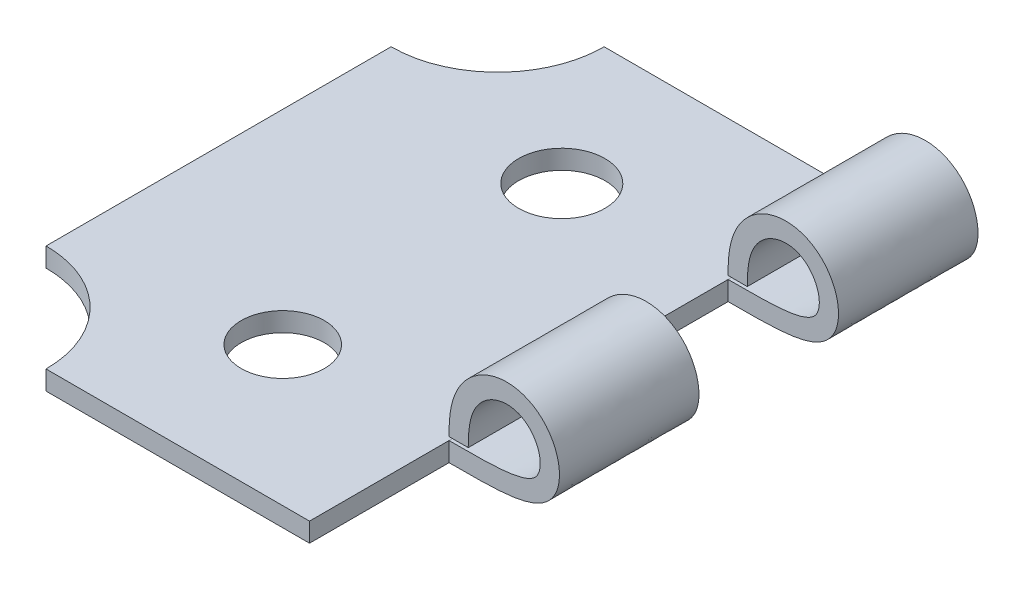
ISO-10303-21;
HEADER;
FILE_DESCRIPTION(('STEP AP214'),'2;1');
FILE_NAME('part.step','',(''),(''),'','','');
FILE_SCHEMA(('AUTOMOTIVE_DESIGN { 1 0 10303 214 1 1 1 1 }'));
ENDSEC;
DATA;
#1=APPLICATION_CONTEXT('core data for automotive mechanical design processes');
#2=APPLICATION_PROTOCOL_DEFINITION('international standard','automotive_design',2000,#1);
#3=PRODUCT_CONTEXT('',#1,'mechanical');
#4=PRODUCT('Part','Part','',(#3));
#5=PRODUCT_RELATED_PRODUCT_CATEGORY('part','',(#4));
#6=PRODUCT_DEFINITION_FORMATION('','',#4);
#7=PRODUCT_DEFINITION_CONTEXT('part definition',#1,'design');
#8=PRODUCT_DEFINITION('design','',#6,#7);
#9=PRODUCT_DEFINITION_SHAPE('','',#8);
#10=(LENGTH_UNIT() NAMED_UNIT(*) SI_UNIT(.MILLI.,.METRE.));
#11=(NAMED_UNIT(*) PLANE_ANGLE_UNIT() SI_UNIT($,.RADIAN.));
#12=(NAMED_UNIT(*) SI_UNIT($,.STERADIAN.) SOLID_ANGLE_UNIT());
#13=UNCERTAINTY_MEASURE_WITH_UNIT(LENGTH_MEASURE(1.E-05),#10,'distance_accuracy_value','');
#14=(GEOMETRIC_REPRESENTATION_CONTEXT(3) GLOBAL_UNCERTAINTY_ASSIGNED_CONTEXT((#13)) GLOBAL_UNIT_ASSIGNED_CONTEXT((#10,
#11,#12)) REPRESENTATION_CONTEXT('',''));
#15=CARTESIAN_POINT('',(0.,0.,0.));
#16=DIRECTION('',(0.,0.,1.));
#17=DIRECTION('',(1.,0.,0.));
#18=AXIS2_PLACEMENT_3D('',#15,#16,#17);
#19=CARTESIAN_POINT('',(-0.000239012399882198,0.55,3.99999999285913));
#20=DIRECTION('',(5.97530999705495E-05,0.,-0.999999998214784));
#21=DIRECTION('',(-0.999999998214784,0.,-5.97530999705495E-05));
#22=AXIS2_PLACEMENT_3D('',#19,#20,#21);
#23=PLANE('',#22);
#24=DIRECTION('',(0.,-1.,0.));
#25=VECTOR('',#24,1.);
#26=CARTESIAN_POINT('',(-1.52678900967465,0.55,3.99990877676436));
#27=LINE('',#26,#25);
#28=CARTESIAN_POINT('',(-1.52678900967465,0.55,3.99990877676437));
#29=VERTEX_POINT('',#28);
#30=CARTESIAN_POINT('',(-1.52678900967465,0.,3.99990877676436));
#31=VERTEX_POINT('',#30);
#32=EDGE_CURVE('E13',#29,#31,#27,.T.);
#33=ORIENTED_EDGE('',*,*,#32,.T.);
#34=CARTESIAN_POINT('',(-1.52678900967465,0.,3.99990877676437));
#35=CARTESIAN_POINT('',(1.5264109848747,0.,4.0000912149292));
#36=CARTESIAN_POINT('',(2.07641098389283,0.,4.00012407913418));
#37=CARTESIAN_POINT('',(2.07641098389283,1.525,4.00012407913418));
#38=CARTESIAN_POINT('',(2.07641098389283,3.6,4.00012407913418));
#39=CARTESIAN_POINT('',(-0.000189012399972787,3.6,3.99999999584678));
#40=CARTESIAN_POINT('',(-1.52678900967465,3.05,3.99990877676437));
#41=CARTESIAN_POINT('',(-1.52678900967465,1.525,3.99990877676437));
#42=CARTESIAN_POINT('',(-1.52678900967465,0.648362597416963,3.99990877676437));
#43=B_SPLINE_CURVE_WITH_KNOTS('',8,(#34,#35,#36,#37,#38,#39,#40,#41,#42),.UNSPECIFIED.,.F.,.F.,
(9,9),(0.,1.),.UNSPECIFIED.);
#44=CARTESIAN_POINT('',(-1.52678900967465,0.648362597416963,3.99990877676437));
#45=VERTEX_POINT('',#44);
#46=EDGE_CURVE('E174',#31,#45,#43,.T.);
#47=ORIENTED_EDGE('',*,*,#46,.T.);
#48=DIRECTION('',(0.999999998214784,0.,5.97530999704648E-05));
#49=VECTOR('',#48,1.);
#50=CARTESIAN_POINT('',(-0.000239012399881859,0.648362597416963,3.99999999285913));
#51=LINE('',#50,#49);
#52=CARTESIAN_POINT('',(-0.976788379677596,0.648362597416963,3.99994164100705));
#53=VERTEX_POINT('',#52);
#54=EDGE_CURVE('E177',#45,#53,#51,.T.);
#55=ORIENTED_EDGE('',*,*,#54,.T.);
#56=CARTESIAN_POINT('',(-1.52678900967465,0.55,3.99990877676436));
#57=CARTESIAN_POINT('',(-0.939259929308912,0.55,3.9999438834483));
#58=CARTESIAN_POINT('',(-0.685275063128425,0.554584755549099,3.99995905983143));
#59=CARTESIAN_POINT('',(-0.160922807899106,0.564049992387804,3.99999039150421));
#60=CARTESIAN_POINT('',(0.154467474412151,0.602229784284035,4.00000923705131));
#61=CARTESIAN_POINT('',(0.396102113145995,0.631481035001628,4.00002367547006));
#62=CARTESIAN_POINT('',(0.566792317174479,0.680821226285321,4.00003387473891));
#63=CARTESIAN_POINT('',(0.65406697747,0.706049085480344,4.00003908967042));
#64=CARTESIAN_POINT('',(0.725989206369396,0.737268298287794,4.00004338724656));
#65=CARTESIAN_POINT('',(0.860810449710886,0.795790025871215,4.00005144323381));
#66=CARTESIAN_POINT('',(0.939375870694469,0.871659303816655,4.00005613776127));
#67=CARTESIAN_POINT('',(1.01011341948005,0.93996933999802,4.0000603645491));
#68=CARTESIAN_POINT('',(1.04974450301157,1.0498012808227,4.0000627326292));
#69=CARTESIAN_POINT('',(1.08406553919289,1.14491717670557,4.00006478341751));
#70=CARTESIAN_POINT('',(1.08768021395796,1.25599731760692,4.00006499940553));
#71=CARTESIAN_POINT('',(1.09098979431639,1.3577018073419,4.00006519716322));
#72=CARTESIAN_POINT('',(1.07016593440565,1.46471447564155,4.00006395287303));
#73=CARTESIAN_POINT('',(1.05032947083376,1.56665296857973,4.00006276758284));
#74=CARTESIAN_POINT('',(1.008684190008,1.66563714611089,4.00006027914821));
#75=CARTESIAN_POINT('',(0.968033938214074,1.76225629864082,4.00005785016964));
#76=CARTESIAN_POINT('',(0.909363472121213,1.8502523090487,4.00005434442741));
#77=CARTESIAN_POINT('',(0.850048946786099,1.93921430196122,4.00005080020064));
#78=CARTESIAN_POINT('',(0.777002762624413,2.01233206312667,4.00004643546469));
#79=CARTESIAN_POINT('',(0.623720930664847,2.16576409395546,4.00003727640005));
#80=CARTESIAN_POINT('',(0.425218763805679,2.23311533346173,4.0000254152802));
#81=CARTESIAN_POINT('',(0.225910821191823,2.30073997046637,4.00001350601276));
#82=CARTESIAN_POINT('',(0.00980928848711269,2.27178911085389,4.00000059327625));
#83=CARTESIAN_POINT('',(-0.19963245886413,2.24373045458864,3.99998807848256));
#84=CARTESIAN_POINT('',(-0.38437747282026,2.13324536497499,3.99997703939525));
#85=CARTESIAN_POINT('',(-0.563957688235082,2.02584903655415,3.99996630892067));
#86=CARTESIAN_POINT('',(-0.693065279025118,1.85241834135162,3.99995859434188));
#87=CARTESIAN_POINT('',(-0.815703270487484,1.68767828240226,3.9999512663417));
#88=CARTESIAN_POINT('',(-0.881246967829014,1.4787534568728,3.99994734990259));
#89=CARTESIAN_POINT('',(-0.936339748798005,1.30314161135999,3.99994405793814));
#90=CARTESIAN_POINT('',(-0.959244164683375,1.06682499225088,3.99994268932829));
#91=CARTESIAN_POINT('',(-0.976789010656517,0.885805807831889,3.99994164096935));
#92=CARTESIAN_POINT('',(-0.976789010656517,0.648362597416963,3.99994164096935));
#93=B_SPLINE_CURVE_WITH_KNOTS('',2,(#56,#57,#58,#59,#60,#61,#62,#63,#64,#65,#66,#67,#68,#69,#70,
#71,#72,#73,#74,#75,#76,#77,#78,#79,#80,#81,#82,#83,#84,#85,#86,#87,#88,#89,#90,#91,#92),
.UNSPECIFIED.,.F.,.F.,(3,2,2,2,2,2,2,2,2,2,2,2,2,2,2,2,2,2,3),(0.,0.125,0.25,0.3125,0.3375,
0.375,0.40625,0.4375,0.46875,0.5,0.53125,0.5625,0.625,0.6875,0.75,0.8125,0.875,0.9375,1.),.UNSPECIFIED.);
#94=EDGE_CURVE('E326',#29,#53,#93,.T.);
#95=ORIENTED_EDGE('',*,*,#94,.F.);
#96=EDGE_LOOP('',(#33,#47,#55,#95));
#97=FACE_BOUND('',#96,.T.);
#98=ADVANCED_FACE('F130',(#97),#23,.F.);
#99=CARTESIAN_POINT('',(0.,0.55,0.));
#100=DIRECTION('',(5.97530999708336E-05,0.,-0.999999998214784));
#101=DIRECTION('',(-0.999999998214784,0.,-5.97530999708336E-05));
#102=AXIS2_PLACEMENT_3D('',#99,#100,#101);
#103=PLANE('',#102);
#104=CARTESIAN_POINT('',(-1.52654999727477,0.,-9.1216094759948E-05));
#105=CARTESIAN_POINT('',(1.52664999727458,0.,9.12220700704722E-05));
#106=CARTESIAN_POINT('',(2.07664999629272,0.,0.000124086275053725));
#107=CARTESIAN_POINT('',(2.07664999629272,1.525,0.000124086275053725));
#108=CARTESIAN_POINT('',(2.07664999629272,3.6,0.000124086275053725));
#109=CARTESIAN_POINT('',(4.99999999094102E-05,3.6,2.98765526207667E-09));
#110=CARTESIAN_POINT('',(-1.52654999727477,3.05,-9.1216094759948E-05));
#111=CARTESIAN_POINT('',(-1.52654999727477,1.525,-9.1216094759948E-05));
#112=CARTESIAN_POINT('',(-1.52654999727477,0.648362597416963,-9.1216094759948E-05));
#113=B_SPLINE_CURVE_WITH_KNOTS('',8,(#104,#105,#106,#107,#108,#109,#110,#111,#112),
.UNSPECIFIED.,.F.,.F.,(9,9),(0.,1.),.UNSPECIFIED.);
#114=CARTESIAN_POINT('',(-1.52654999727477,0.,-9.12160947642848E-05));
#115=VERTEX_POINT('',#114);
#116=CARTESIAN_POINT('',(-1.52654999727477,0.648362597416963,-9.1216094759948E-05));
#117=VERTEX_POINT('',#116);
#118=EDGE_CURVE('E168',#115,#117,#113,.T.);
#119=ORIENTED_EDGE('',*,*,#118,.F.);
#120=DIRECTION('',(0.,-1.,0.));
#121=VECTOR('',#120,1.);
#122=CARTESIAN_POINT('',(-1.52654999727476,0.55,-9.12160947604753E-05));
#123=LINE('',#122,#121);
#124=CARTESIAN_POINT('',(-1.52654999727476,0.55,-9.12160947604753E-05));
#125=VERTEX_POINT('',#124);
#126=EDGE_CURVE('E141',#125,#115,#123,.T.);
#127=ORIENTED_EDGE('',*,*,#126,.F.);
#128=CARTESIAN_POINT('',(-1.52654999727477,0.55,-9.1216094759948E-05));
#129=CARTESIAN_POINT('',(-0.93902091690903,0.55,-5.61094108224303E-05));
#130=CARTESIAN_POINT('',(-0.685036050728543,0.554584755549099,-4.09330276956651E-05));
#131=CARTESIAN_POINT('',(-0.160683795499223,0.564049992387804,-9.60135491338138E-06));
#132=CARTESIAN_POINT('',(0.154706486812033,0.602229784284035,9.24419218863853E-06));
#133=CARTESIAN_POINT('',(0.396341125545877,0.631481035001628,2.36826109391644E-05));
#134=CARTESIAN_POINT('',(0.567031329574361,0.680821226285321,3.38818797827184E-05));
#135=CARTESIAN_POINT('',(0.654305989869882,0.706049085480344,3.90968112936457E-05));
#136=CARTESIAN_POINT('',(0.726228218769278,0.737268298287794,4.33943874349543E-05));
#137=CARTESIAN_POINT('',(0.861049462110768,0.795790025871215,5.14503746811695E-05));
#138=CARTESIAN_POINT('',(0.939614883094351,0.871659303816655,5.614490214325E-05));
#139=CARTESIAN_POINT('',(1.01035243187994,0.93996933999802,6.03716899753165E-05));
#140=CARTESIAN_POINT('',(1.04998351541145,1.0498012808227,6.27397700753846E-05));
#141=CARTESIAN_POINT('',(1.08430455159278,1.14491717670557,6.47905583853886E-05));
#142=CARTESIAN_POINT('',(1.08791922635784,1.25599731760692,6.50065464079946E-05));
#143=CARTESIAN_POINT('',(1.09122880671628,1.3577018073419,6.52043040949568E-05));
#144=CARTESIAN_POINT('',(1.07040494680554,1.46471447564155,6.3960013909313E-05));
#145=CARTESIAN_POINT('',(1.05056848323365,1.56665296857973,6.27747237169282E-05));
#146=CARTESIAN_POINT('',(1.00892320240788,1.66563714611089,6.02862890832292E-05));
#147=CARTESIAN_POINT('',(0.968272950613956,1.76225629864082,5.78573105198057E-05));
#148=CARTESIAN_POINT('',(0.909602484521095,1.8502523090487,5.43515682877027E-05));
#149=CARTESIAN_POINT('',(0.850287959185981,1.93921430196122,5.08073415197291E-05));
#150=CARTESIAN_POINT('',(0.777241775024295,2.01233206312667,4.64426055668543E-05));
#151=CARTESIAN_POINT('',(0.623959943064729,2.16576409395546,3.72835409221187E-05));
#152=CARTESIAN_POINT('',(0.425457776205561,2.23311533346173,2.54224210806051E-05));
#153=CARTESIAN_POINT('',(0.226149833591705,2.30073997046637,1.35131536386016E-05));
#154=CARTESIAN_POINT('',(0.0100483008869949,2.27178911085389,6.0041712834219E-07));
#155=CARTESIAN_POINT('',(-0.199393446464247,2.24373045458864,-1.1914376561728E-05));
#156=CARTESIAN_POINT('',(-0.384138460420378,2.13324536497499,-2.29534638691853E-05));
#157=CARTESIAN_POINT('',(-0.5637186758352,2.02584903655415,-3.36839384527249E-05));
#158=CARTESIAN_POINT('',(-0.692826266625236,1.85241834135162,-4.13985172453488E-05));
#159=CARTESIAN_POINT('',(-0.815464258087602,1.68767828240226,-4.87265174224996E-05));
#160=CARTESIAN_POINT('',(-0.881007955429132,1.4787534568728,-5.26429565295486E-05));
#161=CARTESIAN_POINT('',(-0.936100736398123,1.30314161135999,-5.59349209840534E-05));
#162=CARTESIAN_POINT('',(-0.959005152283493,1.06682499225088,-5.73035308388398E-05));
#163=CARTESIAN_POINT('',(-0.976549998256635,0.885805807831889,-5.83518897758276E-05));
#164=CARTESIAN_POINT('',(-0.976549998256635,0.648362597416963,-5.83518897758276E-05));
#165=B_SPLINE_CURVE_WITH_KNOTS('',2,(#128,#129,#130,#131,#132,#133,#134,#135,#136,#137,#138,
#139,#140,#141,#142,#143,#144,#145,#146,#147,#148,#149,#150,#151,#152,#153,#154,#155,#156,#157,
#158,#159,#160,#161,#162,#163,#164),.UNSPECIFIED.,.F.,.F.,(3,2,2,2,2,2,2,2,2,2,2,2,2,2,2,2,2,2,
3),(0.,0.125,0.25,0.3125,0.3375,0.375,0.40625,0.4375,0.46875,0.5,0.53125,0.5625,0.625,0.6875,
0.75,0.8125,0.875,0.9375,1.),.UNSPECIFIED.);
#166=CARTESIAN_POINT('',(-0.976549367277714,0.648362597416963,-5.83518520744375E-05));
#167=VERTEX_POINT('',#166);
#168=EDGE_CURVE('E178',#125,#167,#165,.T.);
#169=ORIENTED_EDGE('',*,*,#168,.T.);
#170=DIRECTION('',(0.999999998214784,0.,5.97530999708336E-05));
#171=VECTOR('',#170,1.);
#172=CARTESIAN_POINT('',(0.,0.648362597416963,0.));
#173=LINE('',#172,#171);
#174=EDGE_CURVE('E185',#117,#167,#173,.T.);
#175=ORIENTED_EDGE('',*,*,#174,.F.);
#176=EDGE_LOOP('',(#119,#127,#169,#175));
#177=FACE_BOUND('',#176,.T.);
#178=ADVANCED_FACE('F260',(#177),#103,.T.);
#179=CARTESIAN_POINT('',(-1.52654999727476,0.55,-9.12160947600823E-05));
#180=DIRECTION('',(0.999999998214784,0.,5.97530999705762E-05));
#181=DIRECTION('',(5.97530999705762E-05,0.,-0.999999998214784));
#182=AXIS2_PLACEMENT_3D('',#179,#180,#181);
#183=PLANE('',#182);
#184=DIRECTION('',(-5.97530999705762E-05,0.,0.999999998214784));
#185=VECTOR('',#184,1.);
#186=CARTESIAN_POINT('',(-1.52654999727476,0.,-9.12160947600823E-05));
#187=LINE('',#186,#185);
#188=EDGE_CURVE('E323',#115,#31,#187,.T.);
#189=ORIENTED_EDGE('',*,*,#188,.T.);
#190=ORIENTED_EDGE('',*,*,#32,.F.);
#191=CARTESIAN_POINT('',(-1.52654999727477,0.55,-9.12160947590807E-05));
#192=DIRECTION('',(-5.97530999705763E-05,0.,0.999999998214784));
#193=VECTOR('',#192,1.);
#194=LINE('',#191,#193);
#195=EDGE_CURVE('E237',#125,#29,#194,.T.);
#196=ORIENTED_EDGE('',*,*,#195,.F.);
#197=ORIENTED_EDGE('',*,*,#126,.T.);
#198=EDGE_LOOP('',(#189,#190,#196,#197));
#199=FACE_BOUND('',#198,.T.);
#200=ADVANCED_FACE('F132',(#199),#183,.F.);
#201=CARTESIAN_POINT('',(-1.52628255665422,0.,-4.47585264440363));
#202=CARTESIAN_POINT('',(1.52691743789513,0.,-4.4756702062388));
#203=CARTESIAN_POINT('',(2.07691743691326,0.,-4.47563734203381));
#204=CARTESIAN_POINT('',(2.07691743691326,1.525,-4.47563734203381));
#205=CARTESIAN_POINT('',(2.07691743691326,3.6,-4.47563734203381));
#206=CARTESIAN_POINT('',(0.000317440620456919,3.6,-4.47576142532121));
#207=CARTESIAN_POINT('',(-1.52628255665422,3.05,-4.47585264440363));
#208=CARTESIAN_POINT('',(-1.52628255665422,1.525,-4.47585264440363));
#209=CARTESIAN_POINT('',(-1.52628255665422,0.648362597416963,-4.47585264440363));
#210=B_SPLINE_CURVE_WITH_KNOTS('',8,(#201,#202,#203,#204,#205,#206,#207,#208,#209),
.UNSPECIFIED.,.F.,.F.,(9,9),(0.,1.),.UNSPECIFIED.);
#211=DIRECTION('',(-5.97530999705495E-05,0.,0.999999998214783));
#212=VECTOR('',#211,1.);
#213=SURFACE_OF_LINEAR_EXTRUSION('',#210,#212);
#214=ORIENTED_EDGE('',*,*,#46,.F.);
#215=ORIENTED_EDGE('',*,*,#188,.F.);
#216=ORIENTED_EDGE('',*,*,#118,.T.);
#217=DIRECTION('',(-5.97530999705495E-05,0.,0.999999998214783));
#218=VECTOR('',#217,1.);
#219=CARTESIAN_POINT('',(-1.52628255665422,0.648362597416963,-4.47585264440363));
#220=LINE('',#219,#218);
#221=EDGE_CURVE('E181',#117,#45,#220,.T.);
#222=ORIENTED_EDGE('',*,*,#221,.T.);
#223=EDGE_LOOP('',(#214,#215,#216,#222));
#224=FACE_BOUND('',#223,.T.);
#225=ADVANCED_FACE('F182',(#224),#213,.T.);
#226=CARTESIAN_POINT('',(0.000267440620547848,0.648362597416963,-4.47576142830887));
#227=DIRECTION('',(0.,-1.,0.));
#228=DIRECTION('',(0.,0.,-1.));
#229=AXIS2_PLACEMENT_3D('',#226,#227,#228);
#230=PLANE('',#229);
#231=ORIENTED_EDGE('',*,*,#221,.F.);
#232=ORIENTED_EDGE('',*,*,#174,.T.);
#233=CARTESIAN_POINT('',(-0.976789010656517,0.648362597416963,3.99994164096935));
#234=DIRECTION('',(5.97530999705221E-05,0.,-0.999999998214784));
#235=VECTOR('',#234,1.);
#236=LINE('',#233,#235);
#237=EDGE_CURVE('E189',#167,#53,#236,.F.);
#238=ORIENTED_EDGE('',*,*,#237,.T.);
#239=ORIENTED_EDGE('',*,*,#54,.F.);
#240=EDGE_LOOP('',(#231,#232,#238,#239));
#241=FACE_BOUND('',#240,.T.);
#242=ADVANCED_FACE('F187',(#241),#230,.T.);
#243=CARTESIAN_POINT('',(-1.52628255665422,0.55,-4.47585264440363));
#244=CARTESIAN_POINT('',(-0.938753476288482,0.55,-4.47581753771969));
#245=CARTESIAN_POINT('',(-0.684768610107995,0.554584755549099,-4.47580236133656));
#246=CARTESIAN_POINT('',(-0.160416354878676,0.564049992387804,-4.47577102966378));
#247=CARTESIAN_POINT('',(0.15497392743258,0.602229784284035,-4.47575218411668));
#248=CARTESIAN_POINT('',(0.396608566166425,0.631481035001628,-4.47573774569793));
#249=CARTESIAN_POINT('',(0.567298770194909,0.680821226285321,-4.47572754642909));
#250=CARTESIAN_POINT('',(0.65457343049043,0.706049085480344,-4.47572233149757));
#251=CARTESIAN_POINT('',(0.726495659389826,0.737268298287794,-4.47571803392143));
#252=CARTESIAN_POINT('',(0.861316902731316,0.795790025871215,-4.47570997793419));
#253=CARTESIAN_POINT('',(0.939882323714898,0.871659303816655,-4.47570528340672));
#254=CARTESIAN_POINT('',(1.01061987250048,0.93996933999802,-4.47570105661889));
#255=CARTESIAN_POINT('',(1.050250956032,1.0498012808227,-4.47569868853879));
#256=CARTESIAN_POINT('',(1.08457199221332,1.14491717670557,-4.47569663775048));
#257=CARTESIAN_POINT('',(1.08818666697839,1.25599731760692,-4.47569642176246));
#258=CARTESIAN_POINT('',(1.09149624733682,1.3577018073419,-4.47569622400477));
#259=CARTESIAN_POINT('',(1.07067238742608,1.46471447564155,-4.47569746829496));
#260=CARTESIAN_POINT('',(1.05083592385419,1.56665296857973,-4.47569865358515));
#261=CARTESIAN_POINT('',(1.00919064302843,1.66563714611089,-4.47570114201978));
#262=CARTESIAN_POINT('',(0.968540391234504,1.76225629864082,-4.47570357099835));
#263=CARTESIAN_POINT('',(0.909869925141643,1.8502523090487,-4.47570707674058));
#264=CARTESIAN_POINT('',(0.850555399806529,1.93921430196122,-4.47571062096735));
#265=CARTESIAN_POINT('',(0.777509215644842,2.01233206312667,-4.4757149857033));
#266=CARTESIAN_POINT('',(0.624227383685277,2.16576409395546,-4.47572414476795));
#267=CARTESIAN_POINT('',(0.425725216826109,2.23311533346173,-4.47573600588779));
#268=CARTESIAN_POINT('',(0.226417274212253,2.30073997046637,-4.47574791515523));
#269=CARTESIAN_POINT('',(0.0103157415075424,2.27178911085389,-4.47576082789174));
#270=CARTESIAN_POINT('',(-0.1991260058437,2.24373045458864,-4.47577334268543));
#271=CARTESIAN_POINT('',(-0.38387101979983,2.13324536497499,-4.47578438177274));
#272=CARTESIAN_POINT('',(-0.563451235214652,2.02584903655415,-4.47579511224732));
#273=CARTESIAN_POINT('',(-0.692558826004689,1.85241834135162,-4.47580282682611));
#274=CARTESIAN_POINT('',(-0.815196817467054,1.68767828240226,-4.47581015482629));
#275=CARTESIAN_POINT('',(-0.880740514808584,1.4787534568728,-4.4758140712654));
#276=CARTESIAN_POINT('',(-0.935833295777576,1.30314161135999,-4.47581736322985));
#277=CARTESIAN_POINT('',(-0.958737711662945,1.06682499225088,-4.47581873183971));
#278=CARTESIAN_POINT('',(-0.976282557636087,0.885805807831889,-4.47581978019864));
#279=CARTESIAN_POINT('',(-0.976282557636087,0.648362597416963,-4.47581978019864));
#280=B_SPLINE_CURVE_WITH_KNOTS('',2,(#243,#244,#245,#246,#247,#248,#249,#250,#251,#252,#253,
#254,#255,#256,#257,#258,#259,#260,#261,#262,#263,#264,#265,#266,#267,#268,#269,#270,#271,#272,
#273,#274,#275,#276,#277,#278,#279),.UNSPECIFIED.,.F.,.F.,(3,2,2,2,2,2,2,2,2,2,2,2,2,2,2,2,2,2,
3),(0.,0.125,0.25,0.3125,0.3375,0.375,0.40625,0.4375,0.46875,0.5,0.53125,0.5625,0.625,0.6875,
0.75,0.8125,0.875,0.9375,1.),.UNSPECIFIED.);
#281=DIRECTION('',(-5.97530999705495E-05,0.,0.999999998214783));
#282=VECTOR('',#281,1.);
#283=SURFACE_OF_LINEAR_EXTRUSION('',#280,#282);
#284=ORIENTED_EDGE('',*,*,#168,.F.);
#285=ORIENTED_EDGE('',*,*,#195,.T.);
#286=ORIENTED_EDGE('',*,*,#94,.T.);
#287=ORIENTED_EDGE('',*,*,#237,.F.);
#288=EDGE_LOOP('',(#284,#285,#286,#287));
#289=FACE_BOUND('',#288,.T.);
#290=ADVANCED_FACE('F203',(#289),#283,.F.);
#291=CLOSED_SHELL('',(#98,#178,#200,#225,#242,#290));
#292=MANIFOLD_SOLID_BREP('B2',#291);
#293=CARTESIAN_POINT('',(0.000239012399883334,0.55,-3.99999999285913));
#294=DIRECTION('',(5.97530999708336E-05,0.,-0.999999998214784));
#295=DIRECTION('',(-0.999999998214784,0.,-5.97530999708336E-05));
#296=AXIS2_PLACEMENT_3D('',#293,#294,#295);
#297=PLANE('',#296);
#298=DIRECTION('',(0.,-1.,0.));
#299=VECTOR('',#298,1.);
#300=CARTESIAN_POINT('',(-1.52631098487488,0.55,-4.00009120895389));
#301=LINE('',#300,#299);
#302=CARTESIAN_POINT('',(-1.52631098487488,0.55,-4.00009120895389));
#303=VERTEX_POINT('',#302);
#304=CARTESIAN_POINT('',(-1.52631098487488,0.,-4.00009120895389));
#305=VERTEX_POINT('',#304);
#306=EDGE_CURVE('E128',#303,#305,#301,.T.);
#307=ORIENTED_EDGE('',*,*,#306,.T.);
#308=CARTESIAN_POINT('',(-1.52631098487488,0.,-4.00009120895389));
#309=CARTESIAN_POINT('',(1.52688900967447,0.,-3.99990877078906));
#310=CARTESIAN_POINT('',(2.0768890086926,0.,-3.99987590658407));
#311=CARTESIAN_POINT('',(2.0768890086926,1.525,-3.99987590658407));
#312=CARTESIAN_POINT('',(2.0768890086926,3.6,-3.99987590658407));
#313=CARTESIAN_POINT('',(0.000289012399791608,3.6,-3.99999998987147));
#314=CARTESIAN_POINT('',(-1.52631098487488,3.05,-4.00009120895389));
#315=CARTESIAN_POINT('',(-1.52631098487488,1.525,-4.00009120895389));
#316=CARTESIAN_POINT('',(-1.52631098487488,0.648362597416963,-4.00009120895389));
#317=B_SPLINE_CURVE_WITH_KNOTS('',8,(#308,#309,#310,#311,#312,#313,#314,#315,#316),
.UNSPECIFIED.,.F.,.F.,(9,9),(0.,1.),.UNSPECIFIED.);
#318=CARTESIAN_POINT('',(-1.52631098487488,0.648362597416963,-4.00009120895389));
#319=VERTEX_POINT('',#318);
#320=EDGE_CURVE('E430',#305,#319,#317,.T.);
#321=ORIENTED_EDGE('',*,*,#320,.T.);
#322=DIRECTION('',(0.999999998214784,0.,5.97530999708261E-05));
#323=VECTOR('',#322,1.);
#324=CARTESIAN_POINT('',(0.000239012399883304,0.648362597416963,-3.99999999285913));
#325=LINE('',#324,#323);
#326=CARTESIAN_POINT('',(-0.976310354705258,0.648362597416963,-4.00005834471119));
#327=VERTEX_POINT('',#326);
#328=EDGE_CURVE('E466',#319,#327,#325,.T.);
#329=ORIENTED_EDGE('',*,*,#328,.T.);
#330=CARTESIAN_POINT('',(-1.52631098487488,0.550000000000001,-4.00009120895389));
#331=CARTESIAN_POINT('',(-0.938781904509135,0.550000000000001,-4.00005610226995));
#332=CARTESIAN_POINT('',(-0.68479703832866,0.554584755549099,-4.00004092588683));
#333=CARTESIAN_POINT('',(-0.160444783099345,0.564049992387804,-4.00000959421404));
#334=CARTESIAN_POINT('',(0.154945499211916,0.602229784284035,-3.99999074866694));
#335=CARTESIAN_POINT('',(0.396580137945758,0.631481035001627,-3.99997631024819));
#336=CARTESIAN_POINT('',(0.567270341974245,0.680821226285321,-3.99996611097935));
#337=CARTESIAN_POINT('',(0.654545002269765,0.706049085480345,-3.99996089604784));
#338=CARTESIAN_POINT('',(0.726467231169161,0.737268298287794,-3.99995659847169));
#339=CARTESIAN_POINT('',(0.861288474510652,0.795790025871215,-3.99994854248445));
#340=CARTESIAN_POINT('',(0.939853895494234,0.871659303816656,-3.99994384795698));
#341=CARTESIAN_POINT('',(1.01059144427982,0.93996933999802,-3.99993962116915));
#342=CARTESIAN_POINT('',(1.05022252781134,1.0498012808227,-3.99993725308905));
#343=CARTESIAN_POINT('',(1.08454356399266,1.14491717670556,-3.99993520230074));
#344=CARTESIAN_POINT('',(1.08815823875772,1.25599731760692,-3.99993498631272));
#345=CARTESIAN_POINT('',(1.09146781911616,1.35770180734189,-3.99993478855503));
#346=CARTESIAN_POINT('',(1.07064395920542,1.46471447564155,-3.99993603284522));
#347=CARTESIAN_POINT('',(1.05080749563353,1.56665296857973,-3.99993721813541));
#348=CARTESIAN_POINT('',(1.00916221480776,1.66563714611089,-3.99993970657004));
#349=CARTESIAN_POINT('',(0.968511963013837,1.76225629864082,-3.99994213554861));
#350=CARTESIAN_POINT('',(0.909841496920978,1.8502523090487,-3.99994564129084));
#351=CARTESIAN_POINT('',(0.850526971585864,1.93921430196122,-3.99994918551761));
#352=CARTESIAN_POINT('',(0.777480787424177,2.01233206312667,-3.99995355025356));
#353=CARTESIAN_POINT('',(0.624198955464611,2.16576409395546,-3.99996270931821));
#354=CARTESIAN_POINT('',(0.425696788605443,2.23311533346173,-3.99997457043805));
#355=CARTESIAN_POINT('',(0.226388845991587,2.30073997046637,-3.99998647970549));
#356=CARTESIAN_POINT('',(0.0102873132868782,2.2717891108539,-3.999999392442));
#357=CARTESIAN_POINT('',(-0.199154434064364,2.24373045458864,-4.00001190723569));
#358=CARTESIAN_POINT('',(-0.383899448020495,2.13324536497499,-4.000022946323));
#359=CARTESIAN_POINT('',(-0.563479663435318,2.02584903655415,-4.00003367679758));
#360=CARTESIAN_POINT('',(-0.692587254225354,1.85241834135162,-4.00004139137638));
#361=CARTESIAN_POINT('',(-0.815225245687719,1.68767828240226,-4.00004871937655));
#362=CARTESIAN_POINT('',(-0.880768943029249,1.4787534568728,-4.00005263581566));
#363=CARTESIAN_POINT('',(-0.935861723998241,1.30314161135999,-4.00005592778011));
#364=CARTESIAN_POINT('',(-0.95876613988361,1.06682499225088,-4.00005729638997));
#365=CARTESIAN_POINT('',(-0.976310985856752,0.885805807831891,-4.00005834474891));
#366=CARTESIAN_POINT('',(-0.976310985856752,0.648362597416963,-4.00005834474891));
#367=B_SPLINE_CURVE_WITH_KNOTS('',2,(#330,#331,#332,#333,#334,#335,#336,#337,#338,#339,#340,
#341,#342,#343,#344,#345,#346,#347,#348,#349,#350,#351,#352,#353,#354,#355,#356,#357,#358,#359,
#360,#361,#362,#363,#364,#365,#366),.UNSPECIFIED.,.F.,.F.,(3,2,2,2,2,2,2,2,2,2,2,2,2,2,2,2,2,2,
3),(0.,0.125,0.25,0.3125,0.3375,0.375,0.40625,0.4375,0.46875,0.5,0.53125,0.5625,0.625,0.6875,
0.75,0.8125,0.875,0.9375,1.),.UNSPECIFIED.);
#368=EDGE_CURVE('E464',#303,#327,#367,.T.);
#369=ORIENTED_EDGE('',*,*,#368,.F.);
#370=EDGE_LOOP('',(#307,#321,#329,#369));
#371=FACE_BOUND('',#370,.T.);
#372=ADVANCED_FACE('F384',(#371),#297,.F.);
#373=CARTESIAN_POINT('',(0.000478024799764913,0.55,-7.99999998571828));
#374=DIRECTION('',(5.97530999706141E-05,0.,-0.999999998214784));
#375=DIRECTION('',(-0.999999998214784,0.,-5.97530999706141E-05));
#376=AXIS2_PLACEMENT_3D('',#373,#374,#375);
#377=PLANE('',#376);
#378=CARTESIAN_POINT('',(-1.526071972475,0.,-8.00009120181304));
#379=CARTESIAN_POINT('',(1.52712802207435,0.,-7.99990876364821));
#380=CARTESIAN_POINT('',(2.07712802109248,0.,-7.99987589944323));
#381=CARTESIAN_POINT('',(2.07712802109248,1.525,-7.99987589944323));
#382=CARTESIAN_POINT('',(2.07712802109248,3.6,-7.99987589944323));
#383=CARTESIAN_POINT('',(0.000528024799674943,3.6,-7.99999998273062));
#384=CARTESIAN_POINT('',(-1.526071972475,3.05,-8.00009120181304));
#385=CARTESIAN_POINT('',(-1.526071972475,1.525,-8.00009120181304));
#386=CARTESIAN_POINT('',(-1.526071972475,0.648362597416963,-8.00009120181304));
#387=B_SPLINE_CURVE_WITH_KNOTS('',8,(#378,#379,#380,#381,#382,#383,#384,#385,#386),
.UNSPECIFIED.,.F.,.F.,(9,9),(0.,1.),.UNSPECIFIED.);
#388=CARTESIAN_POINT('',(-1.526071972475,0.,-8.00009120181304));
#389=VERTEX_POINT('',#388);
#390=CARTESIAN_POINT('',(-1.526071972475,0.648362597416963,-8.00009120181304));
#391=VERTEX_POINT('',#390);
#392=EDGE_CURVE('E435',#389,#391,#387,.T.);
#393=ORIENTED_EDGE('',*,*,#392,.F.);
#394=DIRECTION('',(0.,-1.,0.));
#395=VECTOR('',#394,1.);
#396=CARTESIAN_POINT('',(-1.526071972475,0.55,-8.00009120181304));
#397=LINE('',#396,#395);
#398=CARTESIAN_POINT('',(-1.526071972475,0.55,-8.00009120181304));
#399=VERTEX_POINT('',#398);
#400=EDGE_CURVE('E395',#399,#389,#397,.T.);
#401=ORIENTED_EDGE('',*,*,#400,.F.);
#402=CARTESIAN_POINT('',(-1.526071972475,0.550000000000001,-8.00009120181304));
#403=CARTESIAN_POINT('',(-0.938542892109251,0.550000000000001,-8.0000560951291));
#404=CARTESIAN_POINT('',(-0.684558025928776,0.554584755549099,-8.00004091874598));
#405=CARTESIAN_POINT('',(-0.160205770699461,0.564049992387804,-8.00000958707319));
#406=CARTESIAN_POINT('',(0.1551845116118,0.602229784284035,-7.99999074152609));
#407=CARTESIAN_POINT('',(0.396819150345642,0.631481035001627,-7.99997630310734));
#408=CARTESIAN_POINT('',(0.567509354374128,0.680821226285321,-7.9999661038385));
#409=CARTESIAN_POINT('',(0.654784014669649,0.706049085480345,-7.99996088890699));
#410=CARTESIAN_POINT('',(0.726706243569045,0.737268298287794,-7.99995659133084));
#411=CARTESIAN_POINT('',(0.861527486910535,0.795790025871215,-7.9999485353436));
#412=CARTESIAN_POINT('',(0.940092907894118,0.871659303816656,-7.99994384081614));
#413=CARTESIAN_POINT('',(1.0108304566797,0.93996933999802,-7.99993961402831));
#414=CARTESIAN_POINT('',(1.05046154021122,1.0498012808227,-7.9999372459482));
#415=CARTESIAN_POINT('',(1.08478257639254,1.14491717670556,-7.9999351951599));
#416=CARTESIAN_POINT('',(1.08839725115761,1.25599731760692,-7.99993497917187));
#417=CARTESIAN_POINT('',(1.09170683151604,1.35770180734189,-7.99993478141419));
#418=CARTESIAN_POINT('',(1.0708829716053,1.46471447564155,-7.99993602570437));
#419=CARTESIAN_POINT('',(1.05104650803341,1.56665296857973,-7.99993721099456));
#420=CARTESIAN_POINT('',(1.00940122720765,1.66563714611089,-7.9999396994292));
#421=CARTESIAN_POINT('',(0.96875097541372,1.76225629864082,-7.99994212840776));
#422=CARTESIAN_POINT('',(0.910080509320861,1.8502523090487,-7.99994563414999));
#423=CARTESIAN_POINT('',(0.850765983985747,1.93921430196122,-7.99994917837676));
#424=CARTESIAN_POINT('',(0.77771979982406,2.01233206312667,-7.99995354311272));
#425=CARTESIAN_POINT('',(0.624437967864494,2.16576409395546,-7.99996270217736));
#426=CARTESIAN_POINT('',(0.425935801005327,2.23311533346173,-7.9999745632972));
#427=CARTESIAN_POINT('',(0.22662785839147,2.30073997046637,-7.99998647256464));
#428=CARTESIAN_POINT('',(0.0105263256867616,2.2717891108539,-7.99999938530115));
#429=CARTESIAN_POINT('',(-0.198915421664481,2.24373045458864,-8.00001190009484));
#430=CARTESIAN_POINT('',(-0.383660435620612,2.13324536497499,-8.00002293918215));
#431=CARTESIAN_POINT('',(-0.563240651035434,2.02584903655415,-8.00003366965673));
#432=CARTESIAN_POINT('',(-0.692348241825471,1.85241834135162,-8.00004138423553));
#433=CARTESIAN_POINT('',(-0.814986233287835,1.68767828240226,-8.0000487122357));
#434=CARTESIAN_POINT('',(-0.880529930629366,1.4787534568728,-8.00005262867481));
#435=CARTESIAN_POINT('',(-0.935622711598357,1.30314161135999,-8.00005592063927));
#436=CARTESIAN_POINT('',(-0.958527127483727,1.06682499225088,-8.00005728924912));
#437=CARTESIAN_POINT('',(-0.976071973456869,0.885805807831891,-8.00005833760806));
#438=CARTESIAN_POINT('',(-0.976071973456869,0.648362597416963,-8.00005833760806));
#439=B_SPLINE_CURVE_WITH_KNOTS('',2,(#402,#403,#404,#405,#406,#407,#408,#409,#410,#411,#412,
#413,#414,#415,#416,#417,#418,#419,#420,#421,#422,#423,#424,#425,#426,#427,#428,#429,#430,#431,
#432,#433,#434,#435,#436,#437,#438),.UNSPECIFIED.,.F.,.F.,(3,2,2,2,2,2,2,2,2,2,2,2,2,2,2,2,2,2,
3),(0.,0.125,0.25,0.3125,0.3375,0.375,0.40625,0.4375,0.46875,0.5,0.53125,0.5625,0.625,0.6875,
0.75,0.8125,0.875,0.9375,1.),.UNSPECIFIED.);
#440=CARTESIAN_POINT('',(-0.976071657881122,0.648362597416963,-8.0000583375892));
#441=VERTEX_POINT('',#440);
#442=EDGE_CURVE('E403',#399,#441,#439,.T.);
#443=ORIENTED_EDGE('',*,*,#442,.T.);
#444=DIRECTION('',(0.999999998214784,0.,5.97530999706141E-05));
#445=VECTOR('',#444,1.);
#446=CARTESIAN_POINT('',(0.000478024799767517,0.648362597416963,-7.99999998571828));
#447=LINE('',#446,#445);
#448=EDGE_CURVE('E438',#391,#441,#447,.T.);
#449=ORIENTED_EDGE('',*,*,#448,.F.);
#450=EDGE_LOOP('',(#393,#401,#443,#449));
#451=FACE_BOUND('',#450,.T.);
#452=ADVANCED_FACE('F436',(#451),#377,.T.);
#453=CARTESIAN_POINT('',(-1.52654999727476,0.55,-9.12160947600823E-05));
#454=DIRECTION('',(0.999999998214784,0.,5.97530999705762E-05));
#455=DIRECTION('',(5.97530999705762E-05,0.,-0.999999998214784));
#456=AXIS2_PLACEMENT_3D('',#453,#454,#455);
#457=PLANE('',#456);
#458=DIRECTION('',(-5.97530999705762E-05,0.,0.999999998214784));
#459=VECTOR('',#458,1.);
#460=CARTESIAN_POINT('',(-1.52654999727476,0.,-9.12160947600823E-05));
#461=LINE('',#460,#459);
#462=EDGE_CURVE('E442',#389,#305,#461,.T.);
#463=ORIENTED_EDGE('',*,*,#462,.T.);
#464=ORIENTED_EDGE('',*,*,#306,.F.);
#465=CARTESIAN_POINT('',(-1.526071972475,0.550000000000001,-8.00009120181304));
#466=DIRECTION('',(-5.97530999708469E-05,0.,0.999999998214783));
#467=VECTOR('',#466,1.);
#468=LINE('',#465,#467);
#469=EDGE_CURVE('E422',#399,#303,#468,.T.);
#470=ORIENTED_EDGE('',*,*,#469,.F.);
#471=ORIENTED_EDGE('',*,*,#400,.T.);
#472=EDGE_LOOP('',(#463,#464,#470,#471));
#473=FACE_BOUND('',#472,.T.);
#474=ADVANCED_FACE('F386',(#473),#457,.F.);
#475=CARTESIAN_POINT('',(-1.52583318153324,0.550000000000001,-11.9963849747924));
#476=CARTESIAN_POINT('',(-0.938304101167496,0.550000000000001,-11.9963498681084));
#477=CARTESIAN_POINT('',(-0.684319234987021,0.554584755549099,-11.9963346917253));
#478=CARTESIAN_POINT('',(-0.159966979757705,0.564049992387804,-11.9963033600525));
#479=CARTESIAN_POINT('',(0.155423302553556,0.602229784284035,-11.9962845145054));
#480=CARTESIAN_POINT('',(0.397057941287398,0.631481035001627,-11.9962700760867));
#481=CARTESIAN_POINT('',(0.567748145315884,0.680821226285321,-11.9962598768178));
#482=CARTESIAN_POINT('',(0.655022805611404,0.706049085480345,-11.9962546618863));
#483=CARTESIAN_POINT('',(0.726945034510801,0.737268298287794,-11.9962503643102));
#484=CARTESIAN_POINT('',(0.861766277852291,0.795790025871215,-11.9962423083229));
#485=CARTESIAN_POINT('',(0.940331698835874,0.871659303816656,-11.9962376137955));
#486=CARTESIAN_POINT('',(1.01106924762146,0.93996933999802,-11.9962333870077));
#487=CARTESIAN_POINT('',(1.05070033115298,1.0498012808227,-11.9962310189276));
#488=CARTESIAN_POINT('',(1.0850213673343,1.14491717670556,-11.9962289681392));
#489=CARTESIAN_POINT('',(1.08863604209936,1.25599731760692,-11.9962287521512));
#490=CARTESIAN_POINT('',(1.0919456224578,1.35770180734189,-11.9962285543935));
#491=CARTESIAN_POINT('',(1.07112176254706,1.46471447564155,-11.9962297986837));
#492=CARTESIAN_POINT('',(1.05128529897517,1.56665296857973,-11.9962309839739));
#493=CARTESIAN_POINT('',(1.0096400181494,1.66563714611089,-11.9962334724085));
#494=CARTESIAN_POINT('',(0.968989766355476,1.76225629864082,-11.9962359013871));
#495=CARTESIAN_POINT('',(0.910319300262617,1.8502523090487,-11.9962394071293));
#496=CARTESIAN_POINT('',(0.851004774927503,1.93921430196122,-11.9962429513561));
#497=CARTESIAN_POINT('',(0.777958590765816,2.01233206312667,-11.9962473160921));
#498=CARTESIAN_POINT('',(0.62467675880625,2.16576409395546,-11.9962564751567));
#499=CARTESIAN_POINT('',(0.426174591947083,2.23311533346173,-11.9962683362765));
#500=CARTESIAN_POINT('',(0.226866649333226,2.30073997046637,-11.996280245544));
#501=CARTESIAN_POINT('',(0.0107651166285175,2.2717891108539,-11.9962931582805));
#502=CARTESIAN_POINT('',(-0.198676630722725,2.24373045458864,-11.9963056730742));
#503=CARTESIAN_POINT('',(-0.383421644678856,2.13324536497499,-11.9963167121615));
#504=CARTESIAN_POINT('',(-0.563001860093678,2.02584903655415,-11.9963274426361));
#505=CARTESIAN_POINT('',(-0.692109450883715,1.85241834135162,-11.9963351572149));
#506=CARTESIAN_POINT('',(-0.814747442346079,1.68767828240226,-11.9963424852151));
#507=CARTESIAN_POINT('',(-0.88029113968761,1.4787534568728,-11.9963464016542));
#508=CARTESIAN_POINT('',(-0.935383920656601,1.30314161135999,-11.9963496936186));
#509=CARTESIAN_POINT('',(-0.958288336541971,1.06682499225088,-11.9963510622285));
#510=CARTESIAN_POINT('',(-0.975833182515113,0.885805807831891,-11.9963521105874));
#511=CARTESIAN_POINT('',(-0.975833182515113,0.648362597416963,-11.9963521105874));
#512=B_SPLINE_CURVE_WITH_KNOTS('',2,(#475,#476,#477,#478,#479,#480,#481,#482,#483,#484,#485,
#486,#487,#488,#489,#490,#491,#492,#493,#494,#495,#496,#497,#498,#499,#500,#501,#502,#503,#504,
#505,#506,#507,#508,#509,#510,#511),.UNSPECIFIED.,.F.,.F.,(3,2,2,2,2,2,2,2,2,2,2,2,2,2,2,2,2,2,
3),(0.,0.125,0.25,0.3125,0.3375,0.375,0.40625,0.4375,0.46875,0.5,0.53125,0.5625,0.625,0.6875,
0.75,0.8125,0.875,0.9375,1.),.UNSPECIFIED.);
#513=DIRECTION('',(-5.97530999708336E-05,0.,0.999999998214783));
#514=VECTOR('',#513,1.);
#515=SURFACE_OF_LINEAR_EXTRUSION('',#512,#514);
#516=ORIENTED_EDGE('',*,*,#442,.F.);
#517=ORIENTED_EDGE('',*,*,#469,.T.);
#518=ORIENTED_EDGE('',*,*,#368,.T.);
#519=CARTESIAN_POINT('',(-0.976310985856752,0.648362597416963,-4.00005834474891));
#520=DIRECTION('',(5.9753099970847E-05,0.,-0.999999998214783));
#521=VECTOR('',#520,1.);
#522=LINE('',#519,#521);
#523=EDGE_CURVE('E439',#441,#327,#522,.F.);
#524=ORIENTED_EDGE('',*,*,#523,.F.);
#525=EDGE_LOOP('',(#516,#517,#518,#524));
#526=FACE_BOUND('',#525,.T.);
#527=ADVANCED_FACE('F493',(#526),#515,.F.);
#528=CARTESIAN_POINT('',(0.000716815741522588,0.648362597416963,-11.9962937586976));
#529=DIRECTION('',(0.,-1.,0.));
#530=DIRECTION('',(0.,0.,-1.));
#531=AXIS2_PLACEMENT_3D('',#528,#529,#530);
#532=PLANE('',#531);
#533=DIRECTION('',(-5.97530999708336E-05,0.,0.999999998214783));
#534=VECTOR('',#533,1.);
#535=CARTESIAN_POINT('',(-1.52583318153324,0.648362597416963,-11.9963849747924));
#536=LINE('',#535,#534);
#537=EDGE_CURVE('E412',#391,#319,#536,.T.);
#538=ORIENTED_EDGE('',*,*,#537,.F.);
#539=ORIENTED_EDGE('',*,*,#448,.T.);
#540=ORIENTED_EDGE('',*,*,#523,.T.);
#541=ORIENTED_EDGE('',*,*,#328,.F.);
#542=EDGE_LOOP('',(#538,#539,#540,#541));
#543=FACE_BOUND('',#542,.T.);
#544=ADVANCED_FACE('F503',(#543),#532,.T.);
#545=CARTESIAN_POINT('',(-1.52583318153324,0.,-11.9963849747924));
#546=CARTESIAN_POINT('',(1.52736681301611,0.,-11.9962025366276));
#547=CARTESIAN_POINT('',(2.07736681203424,0.,-11.9961696724226));
#548=CARTESIAN_POINT('',(2.07736681203424,1.525,-11.9961696724226));
#549=CARTESIAN_POINT('',(2.07736681203424,3.6,-11.9961696724226));
#550=CARTESIAN_POINT('',(0.000766815741430892,3.6,-11.99629375571));
#551=CARTESIAN_POINT('',(-1.52583318153324,3.05,-11.9963849747924));
#552=CARTESIAN_POINT('',(-1.52583318153324,1.525,-11.9963849747924));
#553=CARTESIAN_POINT('',(-1.52583318153324,0.648362597416963,-11.9963849747924));
#554=B_SPLINE_CURVE_WITH_KNOTS('',8,(#545,#546,#547,#548,#549,#550,#551,#552,#553),
.UNSPECIFIED.,.F.,.F.,(9,9),(0.,1.),.UNSPECIFIED.);
#555=DIRECTION('',(-5.97530999708336E-05,0.,0.999999998214783));
#556=VECTOR('',#555,1.);
#557=SURFACE_OF_LINEAR_EXTRUSION('',#554,#556);
#558=ORIENTED_EDGE('',*,*,#320,.F.);
#559=ORIENTED_EDGE('',*,*,#462,.F.);
#560=ORIENTED_EDGE('',*,*,#392,.T.);
#561=ORIENTED_EDGE('',*,*,#537,.T.);
#562=EDGE_LOOP('',(#558,#559,#560,#561));
#563=FACE_BOUND('',#562,.T.);
#564=ADVANCED_FACE('F443',(#563),#557,.T.);
#565=CLOSED_SHELL('',(#372,#452,#474,#527,#544,#564));
#566=MANIFOLD_SOLID_BREP('B7',#565);
#567=CARTESIAN_POINT('',(-9.08242800858651,0.55,7.99945731105198));
#568=CARTESIAN_POINT('',(-9.08232724693403,0.55,6.31315731406243));
#569=CARTESIAN_POINT('',(-10.449245562006,0.55,4.94607563401512));
#570=CARTESIAN_POINT('',(-12.1355455589956,0.55,4.94597487236264));
#571=B_SPLINE_CURVE_WITH_KNOTS('',3,(#567,#568,#569,#570),.UNSPECIFIED.,.F.,.F.,(4,4),(0.,1.),.UNSPECIFIED.);
#572=DIRECTION('',(0.,-1.,0.));
#573=VECTOR('',#572,1.);
#574=SURFACE_OF_LINEAR_EXTRUSION('',#571,#573);
#575=CARTESIAN_POINT('',(-9.08242800858651,0.,7.99945731105198));
#576=CARTESIAN_POINT('',(-9.08232724693403,0.,6.31315731406243));
#577=CARTESIAN_POINT('',(-10.449245562006,0.,4.94607563401512));
#578=CARTESIAN_POINT('',(-12.1355455589956,0.,4.94597487236264));
#579=B_SPLINE_CURVE_WITH_KNOTS('',3,(#575,#576,#577,#578),.UNSPECIFIED.,.F.,.F.,(4,4),(0.,1.),.UNSPECIFIED.);
#580=CARTESIAN_POINT('',(-9.08242800858651,0.,7.99945731105197));
#581=VERTEX_POINT('',#580);
#582=CARTESIAN_POINT('',(-12.1355455589956,0.,4.94597487236264));
#583=VERTEX_POINT('',#582);
#584=EDGE_CURVE('E749',#581,#583,#579,.T.);
#585=ORIENTED_EDGE('',*,*,#584,.F.);
#586=DIRECTION('',(0.,-1.,0.));
#587=VECTOR('',#586,1.);
#588=CARTESIAN_POINT('',(-9.08242800858651,0.55,7.99945731105197));
#589=LINE('',#588,#587);
#590=CARTESIAN_POINT('',(-9.08242800858651,0.55,7.99945731105197));
#591=VERTEX_POINT('',#590);
#592=EDGE_CURVE('E382',#591,#581,#589,.T.);
#593=ORIENTED_EDGE('',*,*,#592,.F.);
#594=CARTESIAN_POINT('',(-12.1355455589956,0.55,4.94597487236264));
#595=VERTEX_POINT('',#594);
#596=EDGE_CURVE('E774',#591,#595,#571,.T.);
#597=ORIENTED_EDGE('',*,*,#596,.T.);
#598=DIRECTION('',(0.,-1.,0.));
#599=VECTOR('',#598,1.);
#600=CARTESIAN_POINT('',(-12.1355455589956,0.55,4.94597487236264));
#601=LINE('',#600,#599);
#602=EDGE_CURVE('E651',#595,#583,#601,.T.);
#603=ORIENTED_EDGE('',*,*,#602,.T.);
#604=EDGE_LOOP('',(#585,#593,#597,#603));
#605=FACE_BOUND('',#604,.T.);
#606=ADVANCED_FACE('F634',(#605),#574,.T.);
#607=CARTESIAN_POINT('',(-0.000478024799763603,0.55,7.99999998571825));
#608=DIRECTION('',(-5.97530999704505E-05,0.,0.999999998214784));
#609=DIRECTION('',(0.999999998214784,0.,5.97530999704505E-05));
#610=AXIS2_PLACEMENT_3D('',#607,#608,#609);
#611=PLANE('',#610);
#612=DIRECTION('',(-0.999999998214784,0.,-5.97530999704505E-05));
#613=VECTOR('',#612,1.);
#614=CARTESIAN_POINT('',(-0.000478024799763603,0.,7.99999998571825));
#615=LINE('',#614,#613);
#616=CARTESIAN_POINT('',(-1.52712802207435,0.,7.99990876364818));
#617=VERTEX_POINT('',#616);
#618=EDGE_CURVE('E744',#617,#581,#615,.T.);
#619=ORIENTED_EDGE('',*,*,#618,.F.);
#620=DIRECTION('',(0.,-1.,0.));
#621=VECTOR('',#620,1.);
#622=CARTESIAN_POINT('',(-1.52712802207435,0.55,7.99990876364818));
#623=LINE('',#622,#621);
#624=CARTESIAN_POINT('',(-1.52712802207435,0.55,7.99990876364818));
#625=VERTEX_POINT('',#624);
#626=EDGE_CURVE('E643',#625,#617,#623,.T.);
#627=ORIENTED_EDGE('',*,*,#626,.F.);
#628=DIRECTION('',(-0.999999998214784,0.,-5.97530999704505E-05));
#629=VECTOR('',#628,1.);
#630=CARTESIAN_POINT('',(-0.000478024799763603,0.55,7.99999998571825));
#631=LINE('',#630,#629);
#632=EDGE_CURVE('E778',#625,#591,#631,.T.);
#633=ORIENTED_EDGE('',*,*,#632,.T.);
#634=ORIENTED_EDGE('',*,*,#592,.T.);
#635=EDGE_LOOP('',(#619,#627,#633,#634));
#636=FACE_BOUND('',#635,.T.);
#637=ADVANCED_FACE('F735',(#636),#611,.T.);
#638=CARTESIAN_POINT('',(-1.52664999727458,0.55,-9.12220700700793E-05));
#639=DIRECTION('',(0.999999998214784,0.,5.97530999705763E-05));
#640=DIRECTION('',(5.97530999705763E-05,0.,-0.999999998214784));
#641=AXIS2_PLACEMENT_3D('',#638,#639,#640);
#642=PLANE('',#641);
#643=DIRECTION('',(-5.97530999705763E-05,0.,0.999999998214784));
#644=VECTOR('',#643,1.);
#645=CARTESIAN_POINT('',(-1.52664999727458,0.,-9.12220700700793E-05));
#646=LINE('',#645,#644);
#647=CARTESIAN_POINT('',(-1.52617197247482,0.,-8.00009120778835));
#648=VERTEX_POINT('',#647);
#649=EDGE_CURVE('E748',#648,#617,#646,.T.);
#650=ORIENTED_EDGE('',*,*,#649,.F.);
#651=DIRECTION('',(0.,-1.,0.));
#652=VECTOR('',#651,1.);
#653=CARTESIAN_POINT('',(-1.52617197247482,0.55,-8.00009120778835));
#654=LINE('',#653,#652);
#655=CARTESIAN_POINT('',(-1.52617197247482,0.55,-8.00009120778835));
#656=VERTEX_POINT('',#655);
#657=EDGE_CURVE('E698',#656,#648,#654,.T.);
#658=ORIENTED_EDGE('',*,*,#657,.F.);
#659=DIRECTION('',(-5.97530999705763E-05,0.,0.999999998214784));
#660=VECTOR('',#659,1.);
#661=CARTESIAN_POINT('',(-1.52664999727458,0.55,-9.12220700700793E-05));
#662=LINE('',#661,#660);
#663=EDGE_CURVE('E709',#656,#625,#662,.T.);
#664=ORIENTED_EDGE('',*,*,#663,.T.);
#665=ORIENTED_EDGE('',*,*,#626,.T.);
#666=EDGE_LOOP('',(#650,#658,#664,#665));
#667=FACE_BOUND('',#666,.T.);
#668=ADVANCED_FACE('F733',(#667),#642,.T.);
#669=CARTESIAN_POINT('',(0.000478024799764913,0.55,-7.99999998571828));
#670=DIRECTION('',(5.97530999706141E-05,0.,-0.999999998214784));
#671=DIRECTION('',(-0.999999998214784,0.,-5.97530999706141E-05));
#672=AXIS2_PLACEMENT_3D('',#669,#670,#671);
#673=PLANE('',#672);
#674=DIRECTION('',(0.999999998214784,0.,5.97530999706141E-05));
#675=VECTOR('',#674,1.);
#676=CARTESIAN_POINT('',(0.000478024799764913,0.,-7.99999998571828));
#677=LINE('',#676,#675);
#678=CARTESIAN_POINT('',(-9.08147195898698,0.,-8.00054266038456));
#679=VERTEX_POINT('',#678);
#680=EDGE_CURVE('E694',#679,#648,#677,.T.);
#681=ORIENTED_EDGE('',*,*,#680,.F.);
#682=DIRECTION('',(0.,-1.,0.));
#683=VECTOR('',#682,1.);
#684=CARTESIAN_POINT('',(-9.08147195898698,0.55,-8.00054266038456));
#685=LINE('',#684,#683);
#686=CARTESIAN_POINT('',(-9.08147195898698,0.55,-8.00054266038456));
#687=VERTEX_POINT('',#686);
#688=EDGE_CURVE('E689',#687,#679,#685,.T.);
#689=ORIENTED_EDGE('',*,*,#688,.F.);
#690=DIRECTION('',(0.999999998214784,0.,5.97530999706141E-05));
#691=VECTOR('',#690,1.);
#692=CARTESIAN_POINT('',(0.000478024799764913,0.55,-7.99999998571828));
#693=LINE('',#692,#691);
#694=EDGE_CURVE('E692',#687,#656,#693,.T.);
#695=ORIENTED_EDGE('',*,*,#694,.T.);
#696=ORIENTED_EDGE('',*,*,#657,.T.);
#697=EDGE_LOOP('',(#681,#689,#695,#696));
#698=FACE_BOUND('',#697,.T.);
#699=ADVANCED_FACE('F691',(#698),#673,.T.);
#700=CARTESIAN_POINT('',(-12.1349543976763,0.55,-4.94742510997548));
#701=CARTESIAN_POINT('',(-10.4486544006867,0.55,-4.947324348323));
#702=CARTESIAN_POINT('',(-9.08157272063946,0.55,-6.31424266339499));
#703=CARTESIAN_POINT('',(-9.08147195898698,0.55,-8.00054266038456));
#704=B_SPLINE_CURVE_WITH_KNOTS('',3,(#700,#701,#702,#703),.UNSPECIFIED.,.F.,.F.,(4,4),(0.,1.),.UNSPECIFIED.);
#705=DIRECTION('',(0.,-1.,0.));
#706=VECTOR('',#705,1.);
#707=SURFACE_OF_LINEAR_EXTRUSION('',#704,#706);
#708=CARTESIAN_POINT('',(-12.1349543976763,0.,-4.94742510997548));
#709=CARTESIAN_POINT('',(-10.4486544006867,0.,-4.947324348323));
#710=CARTESIAN_POINT('',(-9.08157272063946,0.,-6.31424266339499));
#711=CARTESIAN_POINT('',(-9.08147195898698,0.,-8.00054266038456));
#712=B_SPLINE_CURVE_WITH_KNOTS('',3,(#708,#709,#710,#711),.UNSPECIFIED.,.F.,.F.,(4,4),(0.,1.),.UNSPECIFIED.);
#713=CARTESIAN_POINT('',(-12.1349543976763,0.,-4.94742510997548));
#714=VERTEX_POINT('',#713);
#715=EDGE_CURVE('E755',#714,#679,#712,.T.);
#716=ORIENTED_EDGE('',*,*,#715,.F.);
#717=DIRECTION('',(0.,-1.,0.));
#718=VECTOR('',#717,1.);
#719=CARTESIAN_POINT('',(-12.1349543976763,0.55,-4.94742510997548));
#720=LINE('',#719,#718);
#721=CARTESIAN_POINT('',(-12.1349543976763,0.55,-4.94742510997548));
#722=VERTEX_POINT('',#721);
#723=EDGE_CURVE('E670',#722,#714,#720,.T.);
#724=ORIENTED_EDGE('',*,*,#723,.F.);
#725=EDGE_CURVE('E706',#722,#687,#704,.T.);
#726=ORIENTED_EDGE('',*,*,#725,.T.);
#727=ORIENTED_EDGE('',*,*,#688,.T.);
#728=EDGE_LOOP('',(#716,#724,#726,#727));
#729=FACE_BOUND('',#728,.T.);
#730=ADVANCED_FACE('F711',(#729),#707,.T.);
#731=CARTESIAN_POINT('',(-6.29478900116274,0.55,3.99962387398371));
#732=DIRECTION('',(0.,1.,0.));
#733=DIRECTION('',(5.97530999705968E-05,0.,-0.999999998214784));
#734=AXIS2_PLACEMENT_3D('',#731,#732,#733);
#735=ELLIPSE('',#734,1.192,1.192);
#736=DIRECTION('',(0.,-1.,0.));
#737=VECTOR('',#736,1.);
#738=SURFACE_OF_LINEAR_EXTRUSION('',#735,#737);
#739=CARTESIAN_POINT('',(-6.29471777546758,0.55,2.80762387611168));
#740=VERTEX_POINT('',#739);
#741=EDGE_CURVE('E714',#740,#740,#735,.T.);
#742=ORIENTED_EDGE('',*,*,#741,.T.);
#743=EDGE_LOOP('',(#742));
#744=FACE_BOUND('',#743,.T.);
#745=CARTESIAN_POINT('',(-6.29478900116274,0.,3.99962387398371));
#746=DIRECTION('',(0.,1.,0.));
#747=DIRECTION('',(5.97530999705968E-05,0.,-0.999999998214784));
#748=AXIS2_PLACEMENT_3D('',#745,#746,#747);
#749=ELLIPSE('',#748,1.192,1.192);
#750=CARTESIAN_POINT('',(-6.29471777546758,0.,2.80762387611168));
#751=VERTEX_POINT('',#750);
#752=EDGE_CURVE('E768',#751,#751,#749,.T.);
#753=ORIENTED_EDGE('',*,*,#752,.F.);
#754=EDGE_LOOP('',(#753));
#755=FACE_BOUND('',#754,.T.);
#756=ADVANCED_FACE('F728',(#744,#755),#738,.T.);
#757=CARTESIAN_POINT('',(-12.1352499783359,0.55,-0.000725118806418139));
#758=DIRECTION('',(-0.999999998214784,0.,-5.97530999705931E-05));
#759=DIRECTION('',(-5.97530999705931E-05,0.,0.999999998214784));
#760=AXIS2_PLACEMENT_3D('',#757,#758,#759);
#761=PLANE('',#760);
#762=DIRECTION('',(5.97530999705931E-05,0.,-0.999999998214784));
#763=VECTOR('',#762,1.);
#764=CARTESIAN_POINT('',(-12.1352499783359,0.,-0.000725118806418139));
#765=LINE('',#764,#763);
#766=EDGE_CURVE('E762',#583,#714,#765,.T.);
#767=ORIENTED_EDGE('',*,*,#766,.F.);
#768=ORIENTED_EDGE('',*,*,#602,.F.);
#769=DIRECTION('',(5.97530999705931E-05,0.,-0.999999998214784));
#770=VECTOR('',#769,1.);
#771=CARTESIAN_POINT('',(-12.1352499783359,0.55,-0.000725118806418139));
#772=LINE('',#771,#770);
#773=EDGE_CURVE('E712',#595,#722,#772,.T.);
#774=ORIENTED_EDGE('',*,*,#773,.T.);
#775=ORIENTED_EDGE('',*,*,#723,.T.);
#776=EDGE_LOOP('',(#767,#768,#774,#775));
#777=FACE_BOUND('',#776,.T.);
#778=ADVANCED_FACE('F729',(#777),#761,.T.);
#779=CARTESIAN_POINT('',(-6.29431097636298,0.55,-4.00037611173455));
#780=DIRECTION('',(0.,1.,0.));
#781=DIRECTION('',(-0.999999998214784,0.,-5.97530999705968E-05));
#782=AXIS2_PLACEMENT_3D('',#779,#780,#781);
#783=ELLIPSE('',#782,1.2378,1.2378);
#784=DIRECTION('',(0.,-1.,0.));
#785=VECTOR('',#784,1.);
#786=SURFACE_OF_LINEAR_EXTRUSION('',#783,#785);
#787=CARTESIAN_POINT('',(-7.53211097415324,0.55,-4.00045007412169));
#788=VERTEX_POINT('',#787);
#789=EDGE_CURVE('E776',#788,#788,#783,.T.);
#790=ORIENTED_EDGE('',*,*,#789,.T.);
#791=EDGE_LOOP('',(#790));
#792=FACE_BOUND('',#791,.T.);
#793=CARTESIAN_POINT('',(-6.29431097636298,0.,-4.00037611173455));
#794=DIRECTION('',(0.,1.,0.));
#795=DIRECTION('',(-0.999999998214784,0.,-5.97530999705968E-05));
#796=AXIS2_PLACEMENT_3D('',#793,#794,#795);
#797=ELLIPSE('',#796,1.2378,1.2378);
#798=CARTESIAN_POINT('',(-7.53211097415324,0.,-4.00045007412169));
#799=VERTEX_POINT('',#798);
#800=EDGE_CURVE('E771',#799,#799,#797,.T.);
#801=ORIENTED_EDGE('',*,*,#800,.F.);
#802=EDGE_LOOP('',(#801));
#803=FACE_BOUND('',#802,.T.);
#804=ADVANCED_FACE('F787',(#792,#803),#786,.T.);
#805=CARTESIAN_POINT('',(0.,0.55,0.));
#806=DIRECTION('',(0.,1.,0.));
#807=DIRECTION('',(0.,0.,1.));
#808=AXIS2_PLACEMENT_3D('',#805,#806,#807);
#809=PLANE('',#808);
#810=ORIENTED_EDGE('',*,*,#596,.F.);
#811=ORIENTED_EDGE('',*,*,#632,.F.);
#812=ORIENTED_EDGE('',*,*,#663,.F.);
#813=ORIENTED_EDGE('',*,*,#694,.F.);
#814=ORIENTED_EDGE('',*,*,#725,.F.);
#815=ORIENTED_EDGE('',*,*,#773,.F.);
#816=EDGE_LOOP('',(#810,#811,#812,#813,#814,#815));
#817=FACE_BOUND('',#816,.T.);
#818=ORIENTED_EDGE('',*,*,#741,.F.);
#819=EDGE_LOOP('',(#818));
#820=FACE_BOUND('',#819,.T.);
#821=ORIENTED_EDGE('',*,*,#789,.F.);
#822=EDGE_LOOP('',(#821));
#823=FACE_BOUND('',#822,.T.);
#824=ADVANCED_FACE('F703',(#817,#820,#823),#809,.T.);
#825=CARTESIAN_POINT('',(0.,0.,0.));
#826=DIRECTION('',(0.,1.,0.));
#827=DIRECTION('',(0.,0.,1.));
#828=AXIS2_PLACEMENT_3D('',#825,#826,#827);
#829=PLANE('',#828);
#830=ORIENTED_EDGE('',*,*,#584,.T.);
#831=ORIENTED_EDGE('',*,*,#766,.T.);
#832=ORIENTED_EDGE('',*,*,#715,.T.);
#833=ORIENTED_EDGE('',*,*,#680,.T.);
#834=ORIENTED_EDGE('',*,*,#649,.T.);
#835=ORIENTED_EDGE('',*,*,#618,.T.);
#836=EDGE_LOOP('',(#830,#831,#832,#833,#834,#835));
#837=FACE_BOUND('',#836,.T.);
#838=ORIENTED_EDGE('',*,*,#752,.T.);
#839=EDGE_LOOP('',(#838));
#840=FACE_BOUND('',#839,.T.);
#841=ORIENTED_EDGE('',*,*,#800,.T.);
#842=EDGE_LOOP('',(#841));
#843=FACE_BOUND('',#842,.T.);
#844=ADVANCED_FACE('F752',(#837,#840,#843),#829,.F.);
#845=CLOSED_SHELL('',(#606,#637,#668,#699,#730,#756,#778,#804,#824,#844));
#846=MANIFOLD_SOLID_BREP('B122',#845);
#847=ADVANCED_BREP_SHAPE_REPRESENTATION('',(#18,#292,#566,#846),#14);
#848=SHAPE_DEFINITION_REPRESENTATION(#9,#847);
ENDSEC;
END-ISO-10303-21;
